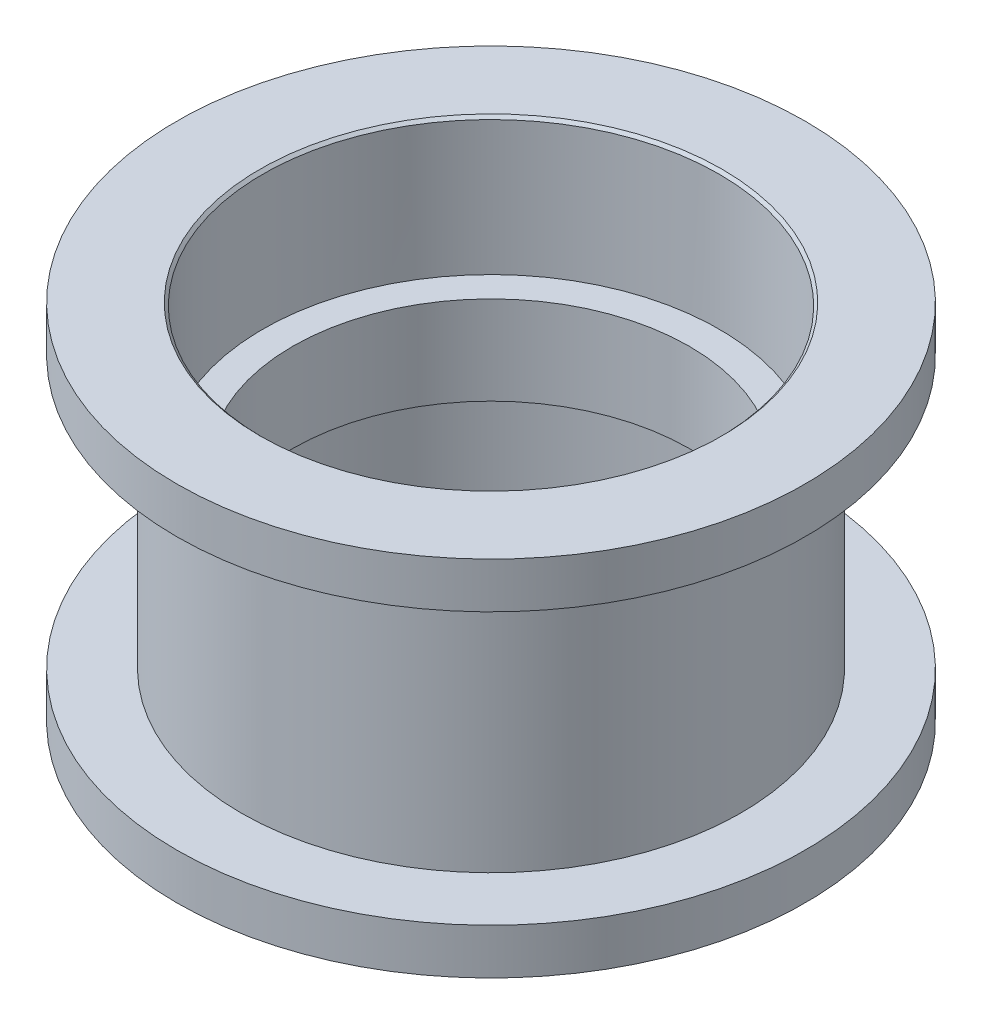
ISO-10303-21;
HEADER;
FILE_DESCRIPTION(('STEP AP214'),'2;1');
FILE_NAME('part.step','',(''),(''),'','','');
FILE_SCHEMA(('AUTOMOTIVE_DESIGN { 1 0 10303 214 1 1 1 1 }'));
ENDSEC;
DATA;
#1=APPLICATION_CONTEXT('core data for automotive mechanical design processes');
#2=APPLICATION_PROTOCOL_DEFINITION('international standard','automotive_design',2000,#1);
#3=PRODUCT_CONTEXT('',#1,'mechanical');
#4=PRODUCT('Part','Part','',(#3));
#5=PRODUCT_RELATED_PRODUCT_CATEGORY('part','',(#4));
#6=PRODUCT_DEFINITION_FORMATION('','',#4);
#7=PRODUCT_DEFINITION_CONTEXT('part definition',#1,'design');
#8=PRODUCT_DEFINITION('design','',#6,#7);
#9=PRODUCT_DEFINITION_SHAPE('','',#8);
#10=(LENGTH_UNIT() NAMED_UNIT(*) SI_UNIT(.MILLI.,.METRE.));
#11=(NAMED_UNIT(*) PLANE_ANGLE_UNIT() SI_UNIT($,.RADIAN.));
#12=(NAMED_UNIT(*) SI_UNIT($,.STERADIAN.) SOLID_ANGLE_UNIT());
#13=UNCERTAINTY_MEASURE_WITH_UNIT(LENGTH_MEASURE(1.E-05),#10,'distance_accuracy_value','');
#14=(GEOMETRIC_REPRESENTATION_CONTEXT(3) GLOBAL_UNCERTAINTY_ASSIGNED_CONTEXT((#13)) GLOBAL_UNIT_ASSIGNED_CONTEXT((#10,
#11,#12)) REPRESENTATION_CONTEXT('',''));
#15=CARTESIAN_POINT('',(0.,0.,0.));
#16=DIRECTION('',(0.,0.,1.));
#17=DIRECTION('',(1.,0.,0.));
#18=AXIS2_PLACEMENT_3D('',#15,#16,#17);
#19=CARTESIAN_POINT('',(6.945,1.55,0.));
#20=DIRECTION('',(0.,-1.,0.));
#21=DIRECTION('',(0.,0.,-1.));
#22=AXIS2_PLACEMENT_3D('',#19,#20,#21);
#23=PLANE('',#22);
#24=CARTESIAN_POINT('',(0.,1.55,0.));
#25=DIRECTION('',(0.,1.,0.));
#26=DIRECTION('',(0.,0.,1.));
#27=AXIS2_PLACEMENT_3D('',#24,#25,#26);
#28=CIRCLE('',#27,6.945);
#29=CARTESIAN_POINT('',(0.,1.55,6.945));
#30=VERTEX_POINT('',#29);
#31=EDGE_CURVE('E53',#30,#30,#28,.T.);
#32=ORIENTED_EDGE('',*,*,#31,.F.);
#33=EDGE_LOOP('',(#32));
#34=FACE_BOUND('',#33,.T.);
#35=CARTESIAN_POINT('',(0.,1.55,0.));
#36=DIRECTION('',(0.,1.,0.));
#37=DIRECTION('',(0.,0.,1.));
#38=AXIS2_PLACEMENT_3D('',#35,#36,#37);
#39=CIRCLE('',#38,7.9875);
#40=CARTESIAN_POINT('',(0.,1.55,7.9875));
#41=VERTEX_POINT('',#40);
#42=EDGE_CURVE('E80',#41,#41,#39,.T.);
#43=ORIENTED_EDGE('',*,*,#42,.T.);
#44=EDGE_LOOP('',(#43));
#45=FACE_BOUND('',#44,.T.);
#46=ADVANCED_FACE('F33',(#34,#45),#23,.F.);
#47=CARTESIAN_POINT('',(0.,30.4981497136174,0.));
#48=DIRECTION('',(0.,1.,0.));
#49=DIRECTION('',(0.,0.,1.));
#50=AXIS2_PLACEMENT_3D('',#47,#48,#49);
#51=CYLINDRICAL_SURFACE('',#50,6.945);
#52=CARTESIAN_POINT('',(0.,-1.55,0.));
#53=DIRECTION('',(0.,1.,0.));
#54=DIRECTION('',(0.,0.,1.));
#55=AXIS2_PLACEMENT_3D('',#52,#53,#54);
#56=CIRCLE('',#55,6.945);
#57=CARTESIAN_POINT('',(0.,-1.55,6.945));
#58=VERTEX_POINT('',#57);
#59=EDGE_CURVE('E56',#58,#58,#56,.T.);
#60=ORIENTED_EDGE('',*,*,#59,.F.);
#61=EDGE_LOOP('',(#60));
#62=FACE_BOUND('',#61,.T.);
#63=ORIENTED_EDGE('',*,*,#31,.T.);
#64=EDGE_LOOP('',(#63));
#65=FACE_BOUND('',#64,.T.);
#66=ADVANCED_FACE('F100',(#62,#65),#51,.F.);
#67=CARTESIAN_POINT('',(6.945,-1.55,0.));
#68=DIRECTION('',(0.,1.,0.));
#69=DIRECTION('',(0.,0.,1.));
#70=AXIS2_PLACEMENT_3D('',#67,#68,#69);
#71=PLANE('',#70);
#72=CARTESIAN_POINT('',(0.,-1.55,0.));
#73=DIRECTION('',(0.,1.,0.));
#74=DIRECTION('',(0.,0.,1.));
#75=AXIS2_PLACEMENT_3D('',#72,#73,#74);
#76=CIRCLE('',#75,7.9875);
#77=CARTESIAN_POINT('',(0.,-1.55,7.9875));
#78=VERTEX_POINT('',#77);
#79=EDGE_CURVE('E59',#78,#78,#76,.T.);
#80=ORIENTED_EDGE('',*,*,#79,.F.);
#81=EDGE_LOOP('',(#80));
#82=FACE_BOUND('',#81,.T.);
#83=ORIENTED_EDGE('',*,*,#59,.T.);
#84=EDGE_LOOP('',(#83));
#85=FACE_BOUND('',#84,.T.);
#86=ADVANCED_FACE('F106',(#82,#85),#71,.F.);
#87=CARTESIAN_POINT('',(0.,30.4981497136174,0.));
#88=DIRECTION('',(0.,1.,0.));
#89=DIRECTION('',(0.,0.,1.));
#90=AXIS2_PLACEMENT_3D('',#87,#88,#89);
#91=CYLINDRICAL_SURFACE('',#90,7.9875);
#92=CARTESIAN_POINT('',(0.,-6.24999999999999,0.));
#93=DIRECTION('',(0.,1.,0.));
#94=DIRECTION('',(0.,0.,1.));
#95=AXIS2_PLACEMENT_3D('',#92,#93,#94);
#96=CIRCLE('',#95,7.9875);
#97=CARTESIAN_POINT('',(0.,-6.24999999999999,7.9875));
#98=VERTEX_POINT('',#97);
#99=EDGE_CURVE('E10',#98,#98,#96,.F.);
#100=ORIENTED_EDGE('',*,*,#99,.T.);
#101=EDGE_LOOP('',(#100));
#102=FACE_BOUND('',#101,.T.);
#103=ORIENTED_EDGE('',*,*,#79,.T.);
#104=EDGE_LOOP('',(#103));
#105=FACE_BOUND('',#104,.T.);
#106=ADVANCED_FACE('F113',(#102,#105),#91,.F.);
#107=CARTESIAN_POINT('',(7.9875,-6.35,0.));
#108=DIRECTION('',(0.,1.,0.));
#109=DIRECTION('',(0.,0.,1.));
#110=AXIS2_PLACEMENT_3D('',#107,#108,#109);
#111=PLANE('',#110);
#112=CARTESIAN_POINT('',(0.,-6.35,0.));
#113=DIRECTION('',(0.,1.,0.));
#114=DIRECTION('',(0.,0.,1.));
#115=AXIS2_PLACEMENT_3D('',#112,#113,#114);
#116=CIRCLE('',#115,8.08750000000001);
#117=CARTESIAN_POINT('',(0.,-6.35,8.08750000000001));
#118=VERTEX_POINT('',#117);
#119=EDGE_CURVE('E40',#118,#118,#116,.T.);
#120=ORIENTED_EDGE('',*,*,#119,.T.);
#121=EDGE_LOOP('',(#120));
#122=FACE_BOUND('',#121,.T.);
#123=CARTESIAN_POINT('',(0.,-6.34999999999999,0.));
#124=DIRECTION('',(0.,1.,0.));
#125=DIRECTION('',(0.,0.,1.));
#126=AXIS2_PLACEMENT_3D('',#123,#124,#125);
#127=CIRCLE('',#126,11.);
#128=CARTESIAN_POINT('',(0.,-6.34999999999999,11.));
#129=VERTEX_POINT('',#128);
#130=EDGE_CURVE('E62',#129,#129,#127,.T.);
#131=ORIENTED_EDGE('',*,*,#130,.F.);
#132=EDGE_LOOP('',(#131));
#133=FACE_BOUND('',#132,.T.);
#134=ADVANCED_FACE('F117',(#122,#133),#111,.F.);
#135=CARTESIAN_POINT('',(0.,30.4981497136174,0.));
#136=DIRECTION('',(0.,1.,0.));
#137=DIRECTION('',(0.,0.,1.));
#138=AXIS2_PLACEMENT_3D('',#135,#136,#137);
#139=CYLINDRICAL_SURFACE('',#138,11.);
#140=CARTESIAN_POINT('',(0.,-4.75,0.));
#141=DIRECTION('',(0.,1.,0.));
#142=DIRECTION('',(0.,0.,1.));
#143=AXIS2_PLACEMENT_3D('',#140,#141,#142);
#144=CIRCLE('',#143,11.);
#145=CARTESIAN_POINT('',(0.,-4.75,11.));
#146=VERTEX_POINT('',#145);
#147=EDGE_CURVE('E65',#146,#146,#144,.T.);
#148=ORIENTED_EDGE('',*,*,#147,.F.);
#149=EDGE_LOOP('',(#148));
#150=FACE_BOUND('',#149,.T.);
#151=ORIENTED_EDGE('',*,*,#130,.T.);
#152=EDGE_LOOP('',(#151));
#153=FACE_BOUND('',#152,.T.);
#154=ADVANCED_FACE('F120',(#150,#153),#139,.T.);
#155=CARTESIAN_POINT('',(11.,-4.75,0.));
#156=DIRECTION('',(0.,-1.,0.));
#157=DIRECTION('',(0.,0.,-1.));
#158=AXIS2_PLACEMENT_3D('',#155,#156,#157);
#159=PLANE('',#158);
#160=CARTESIAN_POINT('',(0.,-4.75,0.));
#161=DIRECTION('',(0.,1.,0.));
#162=DIRECTION('',(0.,0.,1.));
#163=AXIS2_PLACEMENT_3D('',#160,#161,#162);
#164=CIRCLE('',#163,8.75);
#165=CARTESIAN_POINT('',(0.,-4.75,8.75));
#166=VERTEX_POINT('',#165);
#167=EDGE_CURVE('E68',#166,#166,#164,.T.);
#168=ORIENTED_EDGE('',*,*,#167,.F.);
#169=EDGE_LOOP('',(#168));
#170=FACE_BOUND('',#169,.T.);
#171=ORIENTED_EDGE('',*,*,#147,.T.);
#172=EDGE_LOOP('',(#171));
#173=FACE_BOUND('',#172,.T.);
#174=ADVANCED_FACE('F123',(#170,#173),#159,.F.);
#175=CARTESIAN_POINT('',(0.,30.4981497136174,0.));
#176=DIRECTION('',(0.,1.,0.));
#177=DIRECTION('',(0.,0.,1.));
#178=AXIS2_PLACEMENT_3D('',#175,#176,#177);
#179=CYLINDRICAL_SURFACE('',#178,8.75);
#180=CARTESIAN_POINT('',(0.,4.75,0.));
#181=DIRECTION('',(0.,1.,0.));
#182=DIRECTION('',(0.,0.,1.));
#183=AXIS2_PLACEMENT_3D('',#180,#181,#182);
#184=CIRCLE('',#183,8.75);
#185=CARTESIAN_POINT('',(0.,4.75,8.75));
#186=VERTEX_POINT('',#185);
#187=EDGE_CURVE('E71',#186,#186,#184,.T.);
#188=ORIENTED_EDGE('',*,*,#187,.F.);
#189=EDGE_LOOP('',(#188));
#190=FACE_BOUND('',#189,.T.);
#191=ORIENTED_EDGE('',*,*,#167,.T.);
#192=EDGE_LOOP('',(#191));
#193=FACE_BOUND('',#192,.T.);
#194=ADVANCED_FACE('F127',(#190,#193),#179,.T.);
#195=CARTESIAN_POINT('',(11.,4.75,0.));
#196=DIRECTION('',(0.,1.,0.));
#197=DIRECTION('',(0.,0.,1.));
#198=AXIS2_PLACEMENT_3D('',#195,#196,#197);
#199=PLANE('',#198);
#200=CARTESIAN_POINT('',(0.,4.75,0.));
#201=DIRECTION('',(0.,1.,0.));
#202=DIRECTION('',(0.,0.,1.));
#203=AXIS2_PLACEMENT_3D('',#200,#201,#202);
#204=CIRCLE('',#203,11.);
#205=CARTESIAN_POINT('',(0.,4.75,11.));
#206=VERTEX_POINT('',#205);
#207=EDGE_CURVE('E74',#206,#206,#204,.T.);
#208=ORIENTED_EDGE('',*,*,#207,.F.);
#209=EDGE_LOOP('',(#208));
#210=FACE_BOUND('',#209,.T.);
#211=ORIENTED_EDGE('',*,*,#187,.T.);
#212=EDGE_LOOP('',(#211));
#213=FACE_BOUND('',#212,.T.);
#214=ADVANCED_FACE('F131',(#210,#213),#199,.F.);
#215=CARTESIAN_POINT('',(0.,30.4981497136174,0.));
#216=DIRECTION('',(0.,1.,0.));
#217=DIRECTION('',(0.,0.,1.));
#218=AXIS2_PLACEMENT_3D('',#215,#216,#217);
#219=CYLINDRICAL_SURFACE('',#218,11.);
#220=CARTESIAN_POINT('',(0.,6.35,0.));
#221=DIRECTION('',(0.,1.,0.));
#222=DIRECTION('',(0.,0.,1.));
#223=AXIS2_PLACEMENT_3D('',#220,#221,#222);
#224=CIRCLE('',#223,11.);
#225=CARTESIAN_POINT('',(0.,6.35,11.));
#226=VERTEX_POINT('',#225);
#227=EDGE_CURVE('E77',#226,#226,#224,.T.);
#228=ORIENTED_EDGE('',*,*,#227,.F.);
#229=EDGE_LOOP('',(#228));
#230=FACE_BOUND('',#229,.T.);
#231=ORIENTED_EDGE('',*,*,#207,.T.);
#232=EDGE_LOOP('',(#231));
#233=FACE_BOUND('',#232,.T.);
#234=ADVANCED_FACE('F96',(#230,#233),#219,.T.);
#235=CARTESIAN_POINT('',(7.9875,6.35,0.));
#236=DIRECTION('',(0.,-1.,0.));
#237=DIRECTION('',(0.,0.,-1.));
#238=AXIS2_PLACEMENT_3D('',#235,#236,#237);
#239=PLANE('',#238);
#240=CARTESIAN_POINT('',(0.,6.35,0.));
#241=DIRECTION('',(0.,-1.,0.));
#242=DIRECTION('',(0.,0.,-1.));
#243=AXIS2_PLACEMENT_3D('',#240,#241,#242);
#244=CIRCLE('',#243,8.0875);
#245=CARTESIAN_POINT('',(0.,6.35,-8.0875));
#246=VERTEX_POINT('',#245);
#247=EDGE_CURVE('E44',#246,#246,#244,.T.);
#248=ORIENTED_EDGE('',*,*,#247,.T.);
#249=EDGE_LOOP('',(#248));
#250=FACE_BOUND('',#249,.T.);
#251=ORIENTED_EDGE('',*,*,#227,.T.);
#252=EDGE_LOOP('',(#251));
#253=FACE_BOUND('',#252,.T.);
#254=ADVANCED_FACE('F88',(#250,#253),#239,.F.);
#255=CARTESIAN_POINT('',(0.,30.4981497136174,0.));
#256=DIRECTION('',(0.,1.,0.));
#257=DIRECTION('',(0.,0.,1.));
#258=AXIS2_PLACEMENT_3D('',#255,#256,#257);
#259=CYLINDRICAL_SURFACE('',#258,7.9875);
#260=CARTESIAN_POINT('',(0.,6.24999999999999,0.));
#261=DIRECTION('',(0.,-1.,0.));
#262=DIRECTION('',(0.,0.,-1.));
#263=AXIS2_PLACEMENT_3D('',#260,#261,#262);
#264=CIRCLE('',#263,7.9875);
#265=CARTESIAN_POINT('',(0.,6.24999999999999,-7.9875));
#266=VERTEX_POINT('',#265);
#267=EDGE_CURVE('E48',#266,#266,#264,.F.);
#268=ORIENTED_EDGE('',*,*,#267,.T.);
#269=EDGE_LOOP('',(#268));
#270=FACE_BOUND('',#269,.T.);
#271=ORIENTED_EDGE('',*,*,#42,.F.);
#272=EDGE_LOOP('',(#271));
#273=FACE_BOUND('',#272,.T.);
#274=ADVANCED_FACE('F85',(#270,#273),#259,.F.);
#275=CARTESIAN_POINT('',(0.,6.24999999999999,0.));
#276=DIRECTION('',(0.,1.,0.));
#277=DIRECTION('',(0.,0.,1.));
#278=AXIS2_PLACEMENT_3D('',#275,#276,#277);
#279=CONICAL_SURFACE('',#278,7.9875,0.785398163397422);
#280=ORIENTED_EDGE('',*,*,#247,.F.);
#281=EDGE_LOOP('',(#280));
#282=FACE_BOUND('',#281,.T.);
#283=ORIENTED_EDGE('',*,*,#267,.F.);
#284=EDGE_LOOP('',(#283));
#285=FACE_BOUND('',#284,.T.);
#286=ADVANCED_FACE('F87',(#282,#285),#279,.F.);
#287=CARTESIAN_POINT('',(0.,-6.34999999999999,0.));
#288=DIRECTION('',(0.,-1.,0.));
#289=DIRECTION('',(0.,0.,-1.));
#290=AXIS2_PLACEMENT_3D('',#287,#288,#289);
#291=CONICAL_SURFACE('',#290,8.08750000000001,0.785398163397457);
#292=ORIENTED_EDGE('',*,*,#99,.F.);
#293=EDGE_LOOP('',(#292));
#294=FACE_BOUND('',#293,.T.);
#295=ORIENTED_EDGE('',*,*,#119,.F.);
#296=EDGE_LOOP('',(#295));
#297=FACE_BOUND('',#296,.T.);
#298=ADVANCED_FACE('F35',(#294,#297),#291,.F.);
#299=CLOSED_SHELL('',(#46,#66,#86,#106,#134,#154,#174,#194,#214,#234,#254,#274,#286,#298));
#300=MANIFOLD_SOLID_BREP('B2',#299);
#301=ADVANCED_BREP_SHAPE_REPRESENTATION('',(#18,#300),#14);
#302=SHAPE_DEFINITION_REPRESENTATION(#9,#301);
ENDSEC;
END-ISO-10303-21;
